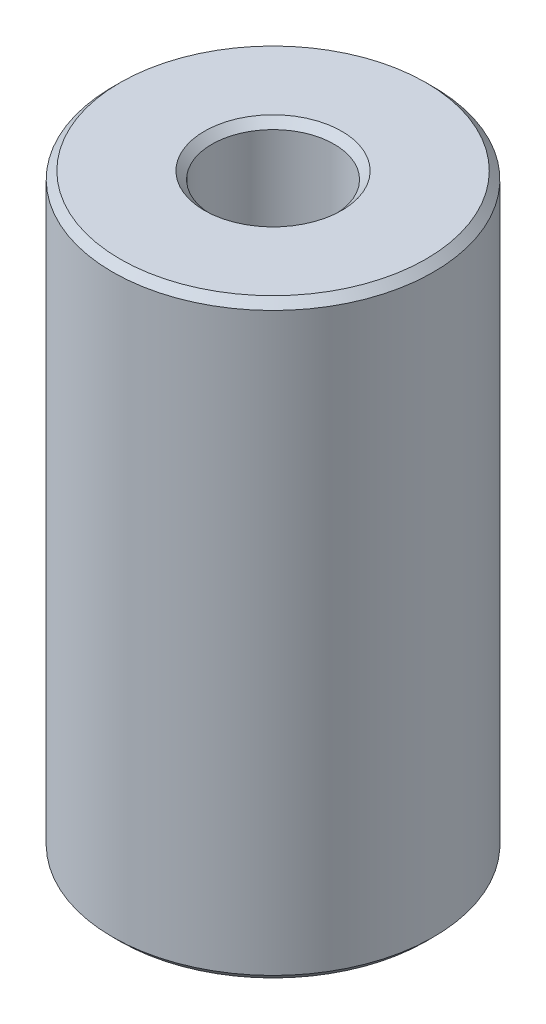
ISO-10303-21;
HEADER;
FILE_DESCRIPTION(('STEP AP214'),'2;1');
FILE_NAME('part.step','',(''),(''),'','','');
FILE_SCHEMA(('AUTOMOTIVE_DESIGN { 1 0 10303 214 1 1 1 1 }'));
ENDSEC;
DATA;
#1=APPLICATION_CONTEXT('core data for automotive mechanical design processes');
#2=APPLICATION_PROTOCOL_DEFINITION('international standard','automotive_design',2000,#1);
#3=PRODUCT_CONTEXT('',#1,'mechanical');
#4=PRODUCT('Part','Part','',(#3));
#5=PRODUCT_RELATED_PRODUCT_CATEGORY('part','',(#4));
#6=PRODUCT_DEFINITION_FORMATION('','',#4);
#7=PRODUCT_DEFINITION_CONTEXT('part definition',#1,'design');
#8=PRODUCT_DEFINITION('design','',#6,#7);
#9=PRODUCT_DEFINITION_SHAPE('','',#8);
#10=(LENGTH_UNIT() NAMED_UNIT(*) SI_UNIT(.MILLI.,.METRE.));
#11=(NAMED_UNIT(*) PLANE_ANGLE_UNIT() SI_UNIT($,.RADIAN.));
#12=(NAMED_UNIT(*) SI_UNIT($,.STERADIAN.) SOLID_ANGLE_UNIT());
#13=UNCERTAINTY_MEASURE_WITH_UNIT(LENGTH_MEASURE(1.E-05),#10,'distance_accuracy_value','');
#14=(GEOMETRIC_REPRESENTATION_CONTEXT(3) GLOBAL_UNCERTAINTY_ASSIGNED_CONTEXT((#13)) GLOBAL_UNIT_ASSIGNED_CONTEXT((#10,
#11,#12)) REPRESENTATION_CONTEXT('',''));
#15=CARTESIAN_POINT('',(0.,0.,0.));
#16=DIRECTION('',(0.,0.,1.));
#17=DIRECTION('',(1.,0.,0.));
#18=AXIS2_PLACEMENT_3D('',#15,#16,#17);
#19=CARTESIAN_POINT('',(0.,147.345333260711,0.));
#20=DIRECTION('',(0.,-1.,0.));
#21=DIRECTION('',(0.,0.,-1.));
#22=AXIS2_PLACEMENT_3D('',#19,#20,#21);
#23=CYLINDRICAL_SURFACE('',#22,40.);
#24=CARTESIAN_POINT('',(0.,1.87253846276958,0.));
#25=DIRECTION('',(0.,1.,0.));
#26=DIRECTION('',(0.,0.,1.));
#27=AXIS2_PLACEMENT_3D('',#24,#25,#26);
#28=CIRCLE('',#27,40.);
#29=CARTESIAN_POINT('',(0.,1.87253846276958,40.));
#30=VERTEX_POINT('',#29);
#31=EDGE_CURVE('E10',#30,#30,#28,.T.);
#32=ORIENTED_EDGE('',*,*,#31,.T.);
#33=EDGE_LOOP('',(#32));
#34=FACE_BOUND('',#33,.T.);
#35=CARTESIAN_POINT('',(0.,145.472794797941,0.));
#36=DIRECTION('',(0.,1.,0.));
#37=DIRECTION('',(0.,0.,1.));
#38=AXIS2_PLACEMENT_3D('',#35,#36,#37);
#39=CIRCLE('',#38,40.);
#40=CARTESIAN_POINT('',(0.,145.472794797941,40.));
#41=VERTEX_POINT('',#40);
#42=EDGE_CURVE('E50',#41,#41,#39,.F.);
#43=ORIENTED_EDGE('',*,*,#42,.T.);
#44=EDGE_LOOP('',(#43));
#45=FACE_BOUND('',#44,.T.);
#46=ADVANCED_FACE('F39',(#34,#45),#23,.T.);
#47=CARTESIAN_POINT('',(0.,147.345333260711,0.));
#48=DIRECTION('',(0.,1.,0.));
#49=DIRECTION('',(0.,0.,1.));
#50=AXIS2_PLACEMENT_3D('',#47,#48,#49);
#51=PLANE('',#50);
#52=CARTESIAN_POINT('',(0.,147.345333260711,0.));
#53=DIRECTION('',(0.,1.,0.));
#54=DIRECTION('',(0.,0.,1.));
#55=AXIS2_PLACEMENT_3D('',#52,#53,#54);
#56=CIRCLE('',#55,17.12871936537);
#57=CARTESIAN_POINT('',(0.,147.345333260711,17.12871936537));
#58=VERTEX_POINT('',#57);
#59=EDGE_CURVE('E58',#58,#58,#56,.F.);
#60=ORIENTED_EDGE('',*,*,#59,.T.);
#61=EDGE_LOOP('',(#60));
#62=FACE_BOUND('',#61,.T.);
#63=CARTESIAN_POINT('',(0.,147.345333260711,0.));
#64=DIRECTION('',(0.,1.,0.));
#65=DIRECTION('',(0.,0.,1.));
#66=AXIS2_PLACEMENT_3D('',#63,#64,#65);
#67=CIRCLE('',#66,38.1274615372304);
#68=CARTESIAN_POINT('',(0.,147.345333260711,38.1274615372304));
#69=VERTEX_POINT('',#68);
#70=EDGE_CURVE('E61',#69,#69,#67,.T.);
#71=ORIENTED_EDGE('',*,*,#70,.T.);
#72=EDGE_LOOP('',(#71));
#73=FACE_BOUND('',#72,.T.);
#74=ADVANCED_FACE('F88',(#62,#73),#51,.T.);
#75=CARTESIAN_POINT('',(0.,0.,0.));
#76=DIRECTION('',(0.,1.,0.));
#77=DIRECTION('',(0.,0.,1.));
#78=AXIS2_PLACEMENT_3D('',#75,#76,#77);
#79=PLANE('',#78);
#80=CARTESIAN_POINT('',(0.,0.,0.));
#81=DIRECTION('',(0.,1.,0.));
#82=DIRECTION('',(0.,0.,1.));
#83=AXIS2_PLACEMENT_3D('',#80,#81,#82);
#84=CIRCLE('',#83,17.12871936537);
#85=CARTESIAN_POINT('',(0.,0.,17.12871936537));
#86=VERTEX_POINT('',#85);
#87=EDGE_CURVE('E51',#86,#86,#84,.T.);
#88=ORIENTED_EDGE('',*,*,#87,.T.);
#89=EDGE_LOOP('',(#88));
#90=FACE_BOUND('',#89,.T.);
#91=CARTESIAN_POINT('',(0.,0.,0.));
#92=DIRECTION('',(0.,1.,0.));
#93=DIRECTION('',(0.,0.,1.));
#94=AXIS2_PLACEMENT_3D('',#91,#92,#93);
#95=CIRCLE('',#94,38.1274615372304);
#96=CARTESIAN_POINT('',(0.,0.,38.1274615372304));
#97=VERTEX_POINT('',#96);
#98=EDGE_CURVE('E54',#97,#97,#95,.F.);
#99=ORIENTED_EDGE('',*,*,#98,.T.);
#100=EDGE_LOOP('',(#99));
#101=FACE_BOUND('',#100,.T.);
#102=ADVANCED_FACE('F83',(#90,#101),#79,.F.);
#103=CARTESIAN_POINT('',(0.,147.345333260711,0.));
#104=DIRECTION('',(0.,-1.,0.));
#105=DIRECTION('',(0.,0.,-1.));
#106=AXIS2_PLACEMENT_3D('',#103,#104,#105);
#107=CYLINDRICAL_SURFACE('',#106,15.2561809026004);
#108=CARTESIAN_POINT('',(0.,145.472794797941,0.));
#109=DIRECTION('',(0.,1.,0.));
#110=DIRECTION('',(0.,0.,1.));
#111=AXIS2_PLACEMENT_3D('',#108,#109,#110);
#112=CIRCLE('',#111,15.2561809026004);
#113=CARTESIAN_POINT('',(0.,145.472794797941,15.2561809026004));
#114=VERTEX_POINT('',#113);
#115=EDGE_CURVE('E67',#114,#114,#112,.T.);
#116=ORIENTED_EDGE('',*,*,#115,.T.);
#117=EDGE_LOOP('',(#116));
#118=FACE_BOUND('',#117,.T.);
#119=CARTESIAN_POINT('',(0.,1.87253846276966,0.));
#120=DIRECTION('',(0.,1.,0.));
#121=DIRECTION('',(0.,0.,1.));
#122=AXIS2_PLACEMENT_3D('',#119,#120,#121);
#123=CIRCLE('',#122,15.2561809026004);
#124=CARTESIAN_POINT('',(0.,1.87253846276966,15.2561809026004));
#125=VERTEX_POINT('',#124);
#126=EDGE_CURVE('E69',#125,#125,#123,.F.);
#127=ORIENTED_EDGE('',*,*,#126,.T.);
#128=EDGE_LOOP('',(#127));
#129=FACE_BOUND('',#128,.T.);
#130=ADVANCED_FACE('F71',(#118,#129),#107,.F.);
#131=CARTESIAN_POINT('',(0.,145.472794797941,0.));
#132=DIRECTION('',(0.,1.,0.));
#133=DIRECTION('',(0.,0.,1.));
#134=AXIS2_PLACEMENT_3D('',#131,#132,#133);
#135=CONICAL_SURFACE('',#134,15.2561809026004,0.785398163397449);
#136=ORIENTED_EDGE('',*,*,#59,.F.);
#137=EDGE_LOOP('',(#136));
#138=FACE_BOUND('',#137,.T.);
#139=ORIENTED_EDGE('',*,*,#115,.F.);
#140=EDGE_LOOP('',(#139));
#141=FACE_BOUND('',#140,.T.);
#142=ADVANCED_FACE('F77',(#138,#141),#135,.F.);
#143=CARTESIAN_POINT('',(0.,0.,0.));
#144=DIRECTION('',(0.,-1.,0.));
#145=DIRECTION('',(0.,0.,-1.));
#146=AXIS2_PLACEMENT_3D('',#143,#144,#145);
#147=CONICAL_SURFACE('',#146,17.12871936537,0.785398163397446);
#148=ORIENTED_EDGE('',*,*,#126,.F.);
#149=EDGE_LOOP('',(#148));
#150=FACE_BOUND('',#149,.T.);
#151=ORIENTED_EDGE('',*,*,#87,.F.);
#152=EDGE_LOOP('',(#151));
#153=FACE_BOUND('',#152,.T.);
#154=ADVANCED_FACE('F73',(#150,#153),#147,.F.);
#155=CARTESIAN_POINT('',(0.,1.87253846276958,0.));
#156=DIRECTION('',(0.,1.,0.));
#157=DIRECTION('',(0.,0.,1.));
#158=AXIS2_PLACEMENT_3D('',#155,#156,#157);
#159=CONICAL_SURFACE('',#158,40.,0.785398163397447);
#160=CARTESIAN_POINT('',(0.,0.,38.1274615372304));
#161=CARTESIAN_POINT('',(0.,0.0195056089871829,38.1469671462176));
#162=CARTESIAN_POINT('',(0.,0.039011217974366,38.1664727552048));
#163=CARTESIAN_POINT('',(0.,0.0780224359487323,38.2054839731792));
#164=CARTESIAN_POINT('',(0.,0.0975280449359154,38.2249895821663));
#165=CARTESIAN_POINT('',(0.,0.136539262910282,38.2640008001407));
#166=CARTESIAN_POINT('',(0.,0.156044871897465,38.2835064091279));
#167=CARTESIAN_POINT('',(0.,0.195056089871831,38.3225176271023));
#168=CARTESIAN_POINT('',(0.,0.214561698859014,38.3420232360894));
#169=CARTESIAN_POINT('',(0.,0.25357291683338,38.3810344540638));
#170=CARTESIAN_POINT('',(0.,0.273078525820563,38.400540063051));
#171=CARTESIAN_POINT('',(0.,0.31208974379493,38.4395512810254));
#172=CARTESIAN_POINT('',(0.,0.331595352782113,38.4590568900125));
#173=CARTESIAN_POINT('',(0.,0.370606570756479,38.4980681079869));
#174=CARTESIAN_POINT('',(0.,0.390112179743662,38.5175737169741));
#175=CARTESIAN_POINT('',(0.,0.429123397718028,38.5565849349485));
#176=CARTESIAN_POINT('',(0.,0.448629006705212,38.5760905439356));
#177=CARTESIAN_POINT('',(0.,0.487640224679578,38.61510176191));
#178=CARTESIAN_POINT('',(0.,0.507145833666761,38.6346073708972));
#179=CARTESIAN_POINT('',(0.,0.546157051641127,38.6736185888716));
#180=CARTESIAN_POINT('',(0.,0.56566266062831,38.6931241978587));
#181=CARTESIAN_POINT('',(0.,0.604673878602677,38.7321354158331));
#182=CARTESIAN_POINT('',(0.,0.62417948758986,38.7516410248203));
#183=CARTESIAN_POINT('',(0.,0.663190705564226,38.7906522427947));
#184=CARTESIAN_POINT('',(0.,0.682696314551409,38.8101578517818));
#185=CARTESIAN_POINT('',(0.,0.721707532525775,38.8491690697562));
#186=CARTESIAN_POINT('',(0.,0.741213141512959,38.8686746787434));
#187=CARTESIAN_POINT('',(0.,0.780224359487324,38.9076858967178));
#188=CARTESIAN_POINT('',(0.,0.799729968474507,38.9271915057049));
#189=CARTESIAN_POINT('',(0.,0.838741186448874,38.9662027236793));
#190=CARTESIAN_POINT('',(0.,0.858246795436058,38.9857083326665));
#191=CARTESIAN_POINT('',(0.,0.897258013410424,39.0247195506408));
#192=CARTESIAN_POINT('',(0.,0.916763622397607,39.044225159628));
#193=CARTESIAN_POINT('',(0.,0.955774840371973,39.0832363776024));
#194=CARTESIAN_POINT('',(0.,0.975280449359156,39.1027419865896));
#195=CARTESIAN_POINT('',(0.,1.01429166733352,39.1417532045639));
#196=CARTESIAN_POINT('',(0.,1.03379727632071,39.1612588135511));
#197=CARTESIAN_POINT('',(0.,1.07280849429507,39.2002700315255));
#198=CARTESIAN_POINT('',(0.,1.09231410328225,39.2197756405127));
#199=CARTESIAN_POINT('',(0.,1.13132532125662,39.258786858487));
#200=CARTESIAN_POINT('',(0.,1.1508309302438,39.2782924674742));
#201=CARTESIAN_POINT('',(0.,1.18984214821817,39.3173036854486));
#202=CARTESIAN_POINT('',(0.,1.20934775720535,39.3368092944358));
#203=CARTESIAN_POINT('',(0.,1.24835897517972,39.3758205124101));
#204=CARTESIAN_POINT('',(0.,1.2678645841669,39.3953261213973));
#205=CARTESIAN_POINT('',(0.,1.30687580214127,39.4343373393717));
#206=CARTESIAN_POINT('',(0.,1.32638141112845,39.4538429483589));
#207=CARTESIAN_POINT('',(0.,1.36539262910282,39.4928541663332));
#208=CARTESIAN_POINT('',(0.,1.38489823809,39.5123597753204));
#209=CARTESIAN_POINT('',(0.,1.42390945606437,39.5513709932948));
#210=CARTESIAN_POINT('',(0.,1.44341506505155,39.570876602282));
#211=CARTESIAN_POINT('',(0.,1.48242628302592,39.6098878202563));
#212=CARTESIAN_POINT('',(0.,1.5019318920131,39.6293934292435));
#213=CARTESIAN_POINT('',(0.,1.54094310998747,39.6684046472179));
#214=CARTESIAN_POINT('',(0.,1.56044871897465,39.6879102562051));
#215=CARTESIAN_POINT('',(0.,1.59945993694902,39.7269214741794));
#216=CARTESIAN_POINT('',(0.,1.6189655459362,39.7464270831666));
#217=CARTESIAN_POINT('',(0.,1.65797676391057,39.785438301141));
#218=CARTESIAN_POINT('',(0.,1.67748237289775,39.8049439101282));
#219=CARTESIAN_POINT('',(0.,1.71649359087211,39.8439551281025));
#220=CARTESIAN_POINT('',(0.,1.7359991998593,39.8634607370897));
#221=CARTESIAN_POINT('',(0.,1.77501041783366,39.9024719550641));
#222=CARTESIAN_POINT('',(0.,1.79451602682085,39.9219775640513));
#223=CARTESIAN_POINT('',(0.,1.83352724479521,39.9609887820256));
#224=CARTESIAN_POINT('',(0.,1.8530328537824,39.9804943910128));
#225=CARTESIAN_POINT('',(0.,1.87253846276958,40.));
#226=B_SPLINE_CURVE_WITH_KNOTS('',3,(#160,#161,#162,#163,#164,#165,#166,#167,#168,#169,#170,
#171,#172,#173,#174,#175,#176,#177,#178,#179,#180,#181,#182,#183,#184,#185,#186,#187,#188,#189,
#190,#191,#192,#193,#194,#195,#196,#197,#198,#199,#200,#201,#202,#203,#204,#205,#206,#207,#208,
#209,#210,#211,#212,#213,#214,#215,#216,#217,#218,#219,#220,#221,#222,#223,#224,#225),
.UNSPECIFIED.,.F.,.F.,(4,2,2,2,2,2,2,2,2,2,2,2,2,2,2,2,2,2,2,2,2,2,2,2,2,2,2,2,2,2,2,2,4),(0.,
0.0827552903160627,0.165510580632125,0.248265870948188,0.331021161264251,0.413776451580314,
0.496531741896376,0.579287032212439,0.662042322528502,0.744797612844564,0.827552903160627,
0.91030819347669,0.993063483792753,1.07581877410882,1.15857406442488,1.24132935474094,
1.324084645057,1.40683993537306,1.48959522568912,1.57235051600519,1.65510580632125,
1.73786109663731,1.82061638695338,1.90337167726944,1.9861269675855,2.06888225790156,
2.15163754821763,2.23439283853369,2.31714812884975,2.39990341916581,2.48265870948188,
2.56541399979794,2.648169290114),.UNSPECIFIED.);
#227=EDGE_CURVE('BSEAM76',#97,#30,#226,.T.);
#228=ORIENTED_EDGE('',*,*,#98,.F.);
#229=ORIENTED_EDGE('',*,*,#31,.F.);
#230=ORIENTED_EDGE('',*,*,#227,.T.);
#231=ORIENTED_EDGE('',*,*,#227,.F.);
#232=EDGE_LOOP('',(#228,#230,#229,#231));
#233=FACE_BOUND('',#232,.T.);
#234=ADVANCED_FACE('F76',(#233),#159,.T.);
#235=CARTESIAN_POINT('',(0.,147.345333260711,0.));
#236=DIRECTION('',(0.,-1.,0.));
#237=DIRECTION('',(0.,0.,-1.));
#238=AXIS2_PLACEMENT_3D('',#235,#236,#237);
#239=CONICAL_SURFACE('',#238,38.1274615372304,0.785398163397439);
#240=ORIENTED_EDGE('',*,*,#42,.F.);
#241=EDGE_LOOP('',(#240));
#242=FACE_BOUND('',#241,.T.);
#243=ORIENTED_EDGE('',*,*,#70,.F.);
#244=EDGE_LOOP('',(#243));
#245=FACE_BOUND('',#244,.T.);
#246=ADVANCED_FACE('F45',(#242,#245),#239,.T.);
#247=CLOSED_SHELL('',(#46,#74,#102,#130,#142,#154,#234,#246));
#248=MANIFOLD_SOLID_BREP('B2',#247);
#249=ADVANCED_BREP_SHAPE_REPRESENTATION('',(#18,#248),#14);
#250=SHAPE_DEFINITION_REPRESENTATION(#9,#249);
ENDSEC;
END-ISO-10303-21;
